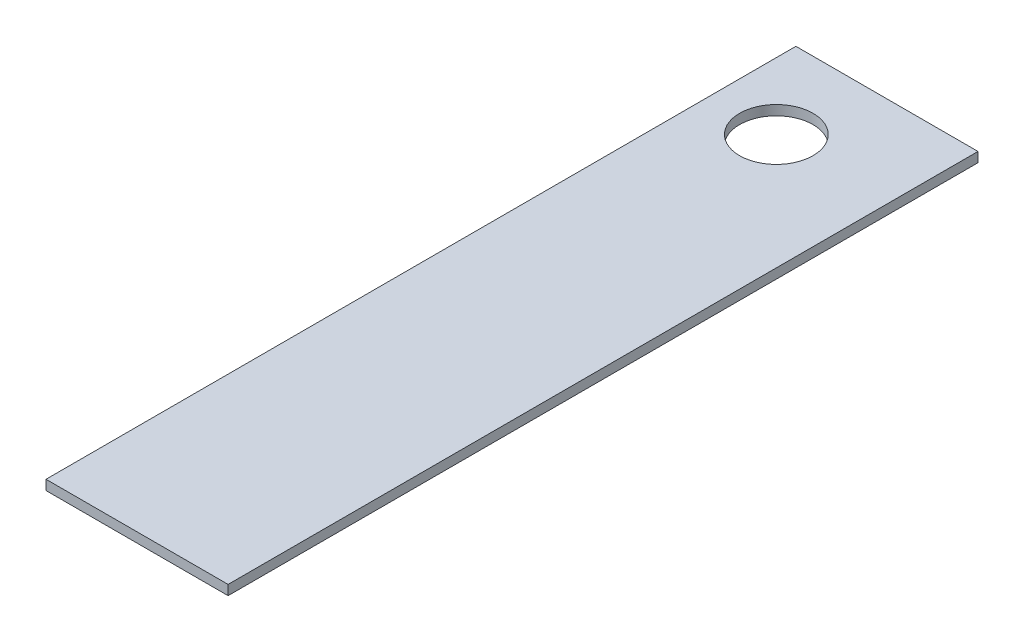
ISO-10303-21;
HEADER;
FILE_DESCRIPTION(('STEP AP214'),'2;1');
FILE_NAME('part.step','',(''),(''),'','','');
FILE_SCHEMA(('AUTOMOTIVE_DESIGN { 1 0 10303 214 1 1 1 1 }'));
ENDSEC;
DATA;
#1=APPLICATION_CONTEXT('core data for automotive mechanical design processes');
#2=APPLICATION_PROTOCOL_DEFINITION('international standard','automotive_design',2000,#1);
#3=PRODUCT_CONTEXT('',#1,'mechanical');
#4=PRODUCT('Part','Part','',(#3));
#5=PRODUCT_RELATED_PRODUCT_CATEGORY('part','',(#4));
#6=PRODUCT_DEFINITION_FORMATION('','',#4);
#7=PRODUCT_DEFINITION_CONTEXT('part definition',#1,'design');
#8=PRODUCT_DEFINITION('design','',#6,#7);
#9=PRODUCT_DEFINITION_SHAPE('','',#8);
#10=(LENGTH_UNIT() NAMED_UNIT(*) SI_UNIT(.MILLI.,.METRE.));
#11=(NAMED_UNIT(*) PLANE_ANGLE_UNIT() SI_UNIT($,.RADIAN.));
#12=(NAMED_UNIT(*) SI_UNIT($,.STERADIAN.) SOLID_ANGLE_UNIT());
#13=UNCERTAINTY_MEASURE_WITH_UNIT(LENGTH_MEASURE(1.E-05),#10,'distance_accuracy_value','');
#14=(GEOMETRIC_REPRESENTATION_CONTEXT(3) GLOBAL_UNCERTAINTY_ASSIGNED_CONTEXT((#13)) GLOBAL_UNIT_ASSIGNED_CONTEXT((#10,
#11,#12)) REPRESENTATION_CONTEXT('',''));
#15=CARTESIAN_POINT('',(0.,0.,0.));
#16=DIRECTION('',(0.,0.,1.));
#17=DIRECTION('',(1.,0.,0.));
#18=AXIS2_PLACEMENT_3D('',#15,#16,#17);
#19=CARTESIAN_POINT('',(0.,1.,0.));
#20=DIRECTION('',(0.,-1.,0.));
#21=DIRECTION('',(0.,0.,-1.));
#22=AXIS2_PLACEMENT_3D('',#19,#20,#21);
#23=PLANE('',#22);
#24=DIRECTION('',(0.,0.,1.));
#25=VECTOR('',#24,1.);
#26=CARTESIAN_POINT('',(-41.0290141513163,1.,14.2823464305479));
#27=LINE('',#26,#25);
#28=CARTESIAN_POINT('',(-41.0290141513163,1.,-62.3176535694521));
#29=VERTEX_POINT('',#28);
#30=CARTESIAN_POINT('',(-41.0290141513163,1.,14.2823464305479));
#31=VERTEX_POINT('',#30);
#32=EDGE_CURVE('E92',#29,#31,#27,.T.);
#33=ORIENTED_EDGE('',*,*,#32,.T.);
#34=DIRECTION('',(1.,0.,0.));
#35=VECTOR('',#34,1.);
#36=CARTESIAN_POINT('',(-41.0290141513163,1.,14.2823464305479));
#37=LINE('',#36,#35);
#38=CARTESIAN_POINT('',(-22.4290141513163,1.,14.2823464305479));
#39=VERTEX_POINT('',#38);
#40=EDGE_CURVE('E87',#31,#39,#37,.T.);
#41=ORIENTED_EDGE('',*,*,#40,.T.);
#42=DIRECTION('',(0.,0.,-1.));
#43=VECTOR('',#42,1.);
#44=CARTESIAN_POINT('',(-22.4290141513163,1.,14.2823464305479));
#45=LINE('',#44,#43);
#46=CARTESIAN_POINT('',(-22.4290141513163,1.,-62.3176535694521));
#47=VERTEX_POINT('',#46);
#48=EDGE_CURVE('E90',#39,#47,#45,.T.);
#49=ORIENTED_EDGE('',*,*,#48,.T.);
#50=DIRECTION('',(-1.,0.,0.));
#51=VECTOR('',#50,1.);
#52=CARTESIAN_POINT('',(-41.0290141513163,1.,-62.3176535694521));
#53=LINE('',#52,#51);
#54=EDGE_CURVE('E57',#47,#29,#53,.T.);
#55=ORIENTED_EDGE('',*,*,#54,.T.);
#56=EDGE_LOOP('',(#33,#41,#49,#55));
#57=FACE_BOUND('',#56,.T.);
#58=CARTESIAN_POINT('',(-34.2290141513163,1.,-53.5176535694521));
#59=DIRECTION('',(0.,1.,0.));
#60=DIRECTION('',(0.,0.,1.));
#61=AXIS2_PLACEMENT_3D('',#58,#59,#60);
#62=CIRCLE('',#61,3.75);
#63=CARTESIAN_POINT('',(-34.2290141513163,1.,-49.7676535694521));
#64=VERTEX_POINT('',#63);
#65=EDGE_CURVE('E112',#64,#64,#62,.T.);
#66=ORIENTED_EDGE('',*,*,#65,.F.);
#67=EDGE_LOOP('',(#66));
#68=FACE_BOUND('',#67,.T.);
#69=ADVANCED_FACE('F39',(#57,#68),#23,.F.);
#70=CARTESIAN_POINT('',(0.,0.,0.));
#71=DIRECTION('',(0.,-1.,0.));
#72=DIRECTION('',(0.,0.,-1.));
#73=AXIS2_PLACEMENT_3D('',#70,#71,#72);
#74=PLANE('',#73);
#75=DIRECTION('',(0.,0.,1.));
#76=VECTOR('',#75,1.);
#77=CARTESIAN_POINT('',(-41.0290141513163,0.,14.2823464305479));
#78=LINE('',#77,#76);
#79=CARTESIAN_POINT('',(-41.0290141513163,0.,-62.3176535694521));
#80=VERTEX_POINT('',#79);
#81=CARTESIAN_POINT('',(-41.0290141513163,0.,14.2823464305479));
#82=VERTEX_POINT('',#81);
#83=EDGE_CURVE('E108',#80,#82,#78,.T.);
#84=ORIENTED_EDGE('',*,*,#83,.F.);
#85=DIRECTION('',(-1.,0.,0.));
#86=VECTOR('',#85,1.);
#87=CARTESIAN_POINT('',(-41.0290141513163,0.,-62.3176535694521));
#88=LINE('',#87,#86);
#89=CARTESIAN_POINT('',(-22.4290141513163,0.,-62.3176535694521));
#90=VERTEX_POINT('',#89);
#91=EDGE_CURVE('E80',#90,#80,#88,.T.);
#92=ORIENTED_EDGE('',*,*,#91,.F.);
#93=DIRECTION('',(0.,0.,-1.));
#94=VECTOR('',#93,1.);
#95=CARTESIAN_POINT('',(-22.4290141513163,0.,14.2823464305479));
#96=LINE('',#95,#94);
#97=CARTESIAN_POINT('',(-22.4290141513163,0.,14.2823464305479));
#98=VERTEX_POINT('',#97);
#99=EDGE_CURVE('E74',#98,#90,#96,.T.);
#100=ORIENTED_EDGE('',*,*,#99,.F.);
#101=DIRECTION('',(1.,0.,0.));
#102=VECTOR('',#101,1.);
#103=CARTESIAN_POINT('',(-41.0290141513163,0.,14.2823464305479));
#104=LINE('',#103,#102);
#105=EDGE_CURVE('E97',#82,#98,#104,.T.);
#106=ORIENTED_EDGE('',*,*,#105,.F.);
#107=EDGE_LOOP('',(#84,#92,#100,#106));
#108=FACE_BOUND('',#107,.T.);
#109=CARTESIAN_POINT('',(-34.2290141513163,0.,-53.5176535694521));
#110=DIRECTION('',(0.,1.,0.));
#111=DIRECTION('',(0.,0.,1.));
#112=AXIS2_PLACEMENT_3D('',#109,#110,#111);
#113=CIRCLE('',#112,3.75);
#114=CARTESIAN_POINT('',(-34.2290141513163,0.,-49.7676535694521));
#115=VERTEX_POINT('',#114);
#116=EDGE_CURVE('E130',#115,#115,#113,.T.);
#117=ORIENTED_EDGE('',*,*,#116,.T.);
#118=EDGE_LOOP('',(#117));
#119=FACE_BOUND('',#118,.T.);
#120=ADVANCED_FACE('F125',(#108,#119),#74,.T.);
#121=CARTESIAN_POINT('',(-41.0290141513163,1.,14.2823464305479));
#122=DIRECTION('',(1.,0.,0.));
#123=DIRECTION('',(0.,0.,-1.));
#124=AXIS2_PLACEMENT_3D('',#121,#122,#123);
#125=PLANE('',#124);
#126=ORIENTED_EDGE('',*,*,#83,.T.);
#127=DIRECTION('',(0.,-1.,0.));
#128=VECTOR('',#127,1.);
#129=CARTESIAN_POINT('',(-41.0290141513163,1.,14.2823464305479));
#130=LINE('',#129,#128);
#131=EDGE_CURVE('E11',#31,#82,#130,.T.);
#132=ORIENTED_EDGE('',*,*,#131,.F.);
#133=ORIENTED_EDGE('',*,*,#32,.F.);
#134=DIRECTION('',(0.,-1.,0.));
#135=VECTOR('',#134,1.);
#136=CARTESIAN_POINT('',(-41.0290141513163,1.,-62.3176535694521));
#137=LINE('',#136,#135);
#138=EDGE_CURVE('E104',#29,#80,#137,.T.);
#139=ORIENTED_EDGE('',*,*,#138,.T.);
#140=EDGE_LOOP('',(#126,#132,#133,#139));
#141=FACE_BOUND('',#140,.T.);
#142=ADVANCED_FACE('F41',(#141),#125,.F.);
#143=CARTESIAN_POINT('',(-41.0290141513163,1.,14.2823464305479));
#144=DIRECTION('',(0.,0.,-1.));
#145=DIRECTION('',(-1.,0.,0.));
#146=AXIS2_PLACEMENT_3D('',#143,#144,#145);
#147=PLANE('',#146);
#148=ORIENTED_EDGE('',*,*,#105,.T.);
#149=DIRECTION('',(0.,-1.,0.));
#150=VECTOR('',#149,1.);
#151=CARTESIAN_POINT('',(-22.4290141513163,1.,14.2823464305479));
#152=LINE('',#151,#150);
#153=EDGE_CURVE('E49',#39,#98,#152,.T.);
#154=ORIENTED_EDGE('',*,*,#153,.F.);
#155=ORIENTED_EDGE('',*,*,#40,.F.);
#156=ORIENTED_EDGE('',*,*,#131,.T.);
#157=EDGE_LOOP('',(#148,#154,#155,#156));
#158=FACE_BOUND('',#157,.T.);
#159=ADVANCED_FACE('F96',(#158),#147,.F.);
#160=CARTESIAN_POINT('',(-22.4290141513163,1.,14.2823464305479));
#161=DIRECTION('',(-1.,0.,0.));
#162=DIRECTION('',(0.,0.,1.));
#163=AXIS2_PLACEMENT_3D('',#160,#161,#162);
#164=PLANE('',#163);
#165=ORIENTED_EDGE('',*,*,#99,.T.);
#166=DIRECTION('',(0.,-1.,0.));
#167=VECTOR('',#166,1.);
#168=CARTESIAN_POINT('',(-22.4290141513163,1.,-62.3176535694521));
#169=LINE('',#168,#167);
#170=EDGE_CURVE('E99',#47,#90,#169,.T.);
#171=ORIENTED_EDGE('',*,*,#170,.F.);
#172=ORIENTED_EDGE('',*,*,#48,.F.);
#173=ORIENTED_EDGE('',*,*,#153,.T.);
#174=EDGE_LOOP('',(#165,#171,#172,#173));
#175=FACE_BOUND('',#174,.T.);
#176=ADVANCED_FACE('F100',(#175),#164,.F.);
#177=CARTESIAN_POINT('',(-41.0290141513163,1.,-62.3176535694521));
#178=DIRECTION('',(0.,0.,1.));
#179=DIRECTION('',(1.,0.,0.));
#180=AXIS2_PLACEMENT_3D('',#177,#178,#179);
#181=PLANE('',#180);
#182=ORIENTED_EDGE('',*,*,#91,.T.);
#183=ORIENTED_EDGE('',*,*,#138,.F.);
#184=ORIENTED_EDGE('',*,*,#54,.F.);
#185=ORIENTED_EDGE('',*,*,#170,.T.);
#186=EDGE_LOOP('',(#182,#183,#184,#185));
#187=FACE_BOUND('',#186,.T.);
#188=ADVANCED_FACE('F122',(#187),#181,.F.);
#189=CARTESIAN_POINT('',(-34.2290141513163,1.,-53.5176535694521));
#190=DIRECTION('',(0.,-1.,0.));
#191=DIRECTION('',(0.,0.,-1.));
#192=AXIS2_PLACEMENT_3D('',#189,#190,#191);
#193=CYLINDRICAL_SURFACE('',#192,3.75);
#194=ORIENTED_EDGE('',*,*,#65,.T.);
#195=EDGE_LOOP('',(#194));
#196=FACE_BOUND('',#195,.T.);
#197=ORIENTED_EDGE('',*,*,#116,.F.);
#198=EDGE_LOOP('',(#197));
#199=FACE_BOUND('',#198,.T.);
#200=ADVANCED_FACE('F138',(#196,#199),#193,.F.);
#201=CLOSED_SHELL('',(#69,#120,#142,#159,#176,#188,#200));
#202=MANIFOLD_SOLID_BREP('B2',#201);
#203=ADVANCED_BREP_SHAPE_REPRESENTATION('',(#18,#202),#14);
#204=SHAPE_DEFINITION_REPRESENTATION(#9,#203);
ENDSEC;
END-ISO-10303-21;
